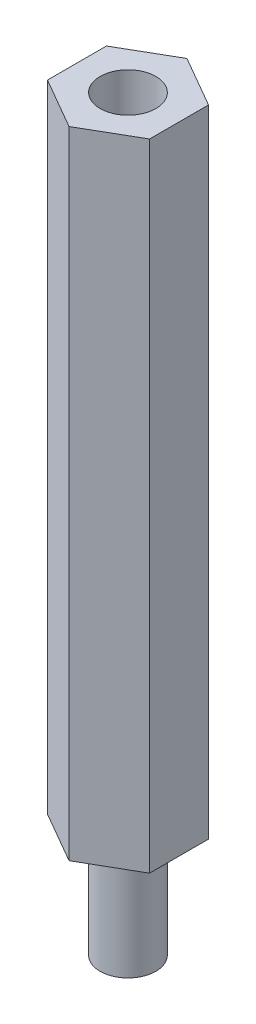
ISO-10303-21;
HEADER;
FILE_DESCRIPTION(('STEP AP214'),'2;1');
FILE_NAME('part.step','',(''),(''),'','','');
FILE_SCHEMA(('AUTOMOTIVE_DESIGN { 1 0 10303 214 1 1 1 1 }'));
ENDSEC;
DATA;
#1=APPLICATION_CONTEXT('core data for automotive mechanical design processes');
#2=APPLICATION_PROTOCOL_DEFINITION('international standard','automotive_design',2000,#1);
#3=PRODUCT_CONTEXT('',#1,'mechanical');
#4=PRODUCT('Part','Part','',(#3));
#5=PRODUCT_RELATED_PRODUCT_CATEGORY('part','',(#4));
#6=PRODUCT_DEFINITION_FORMATION('','',#4);
#7=PRODUCT_DEFINITION_CONTEXT('part definition',#1,'design');
#8=PRODUCT_DEFINITION('design','',#6,#7);
#9=PRODUCT_DEFINITION_SHAPE('','',#8);
#10=(LENGTH_UNIT() NAMED_UNIT(*) SI_UNIT(.MILLI.,.METRE.));
#11=(NAMED_UNIT(*) PLANE_ANGLE_UNIT() SI_UNIT($,.RADIAN.));
#12=(NAMED_UNIT(*) SI_UNIT($,.STERADIAN.) SOLID_ANGLE_UNIT());
#13=UNCERTAINTY_MEASURE_WITH_UNIT(LENGTH_MEASURE(1.E-05),#10,'distance_accuracy_value','');
#14=(GEOMETRIC_REPRESENTATION_CONTEXT(3) GLOBAL_UNCERTAINTY_ASSIGNED_CONTEXT((#13)) GLOBAL_UNIT_ASSIGNED_CONTEXT((#10,
#11,#12)) REPRESENTATION_CONTEXT('',''));
#15=CARTESIAN_POINT('',(0.,0.,0.));
#16=DIRECTION('',(0.,0.,1.));
#17=DIRECTION('',(1.,0.,0.));
#18=AXIS2_PLACEMENT_3D('',#15,#16,#17);
#19=CARTESIAN_POINT('',(-1.397,34.798,2.41967497817372));
#20=DIRECTION('',(0.5,0.,-0.866025403784438));
#21=DIRECTION('',(-0.866025403784438,0.,-0.5));
#22=AXIS2_PLACEMENT_3D('',#19,#20,#21);
#23=PLANE('',#22);
#24=DIRECTION('',(0.866025403784438,0.,0.5));
#25=VECTOR('',#24,1.);
#26=CARTESIAN_POINT('',(-1.397,0.,2.41967497817372));
#27=LINE('',#26,#25);
#28=CARTESIAN_POINT('',(-2.794,0.,1.61311665211581));
#29=VERTEX_POINT('',#28);
#30=CARTESIAN_POINT('',(0.,0.,3.22623330423163));
#31=VERTEX_POINT('',#30);
#32=EDGE_CURVE('E118',#29,#31,#27,.T.);
#33=ORIENTED_EDGE('',*,*,#32,.T.);
#34=DIRECTION('',(0.,-1.,0.));
#35=VECTOR('',#34,1.);
#36=CARTESIAN_POINT('',(0.,34.798,3.22623330423163));
#37=LINE('',#36,#35);
#38=CARTESIAN_POINT('',(0.,34.798,3.22623330423163));
#39=VERTEX_POINT('',#38);
#40=EDGE_CURVE('E11',#39,#31,#37,.T.);
#41=ORIENTED_EDGE('',*,*,#40,.F.);
#42=DIRECTION('',(0.866025403784438,0.,0.5));
#43=VECTOR('',#42,1.);
#44=CARTESIAN_POINT('',(-1.397,34.798,2.41967497817372));
#45=LINE('',#44,#43);
#46=CARTESIAN_POINT('',(-2.794,34.798,1.61311665211581));
#47=VERTEX_POINT('',#46);
#48=EDGE_CURVE('E129',#47,#39,#45,.T.);
#49=ORIENTED_EDGE('',*,*,#48,.F.);
#50=DIRECTION('',(0.,-1.,0.));
#51=VECTOR('',#50,1.);
#52=CARTESIAN_POINT('',(-2.794,34.798,1.61311665211581));
#53=LINE('',#52,#51);
#54=EDGE_CURVE('E114',#47,#29,#53,.T.);
#55=ORIENTED_EDGE('',*,*,#54,.T.);
#56=EDGE_LOOP('',(#33,#41,#49,#55));
#57=FACE_BOUND('',#56,.T.);
#58=ADVANCED_FACE('F34',(#57),#23,.F.);
#59=CARTESIAN_POINT('',(1.397,34.798,2.41967497817372));
#60=DIRECTION('',(-0.5,0.,-0.866025403784439));
#61=DIRECTION('',(-0.866025403784439,0.,0.5));
#62=AXIS2_PLACEMENT_3D('',#59,#60,#61);
#63=PLANE('',#62);
#64=DIRECTION('',(0.866025403784439,0.,-0.5));
#65=VECTOR('',#64,1.);
#66=CARTESIAN_POINT('',(1.397,0.,2.41967497817372));
#67=LINE('',#66,#65);
#68=CARTESIAN_POINT('',(2.794,0.,1.61311665211582));
#69=VERTEX_POINT('',#68);
#70=EDGE_CURVE('E121',#31,#69,#67,.T.);
#71=ORIENTED_EDGE('',*,*,#70,.T.);
#72=DIRECTION('',(0.,-1.,0.));
#73=VECTOR('',#72,1.);
#74=CARTESIAN_POINT('',(2.794,34.798,1.61311665211582));
#75=LINE('',#74,#73);
#76=CARTESIAN_POINT('',(2.794,34.798,1.61311665211582));
#77=VERTEX_POINT('',#76);
#78=EDGE_CURVE('E42',#77,#69,#75,.T.);
#79=ORIENTED_EDGE('',*,*,#78,.F.);
#80=DIRECTION('',(0.866025403784439,0.,-0.5));
#81=VECTOR('',#80,1.);
#82=CARTESIAN_POINT('',(1.397,34.798,2.41967497817372));
#83=LINE('',#82,#81);
#84=EDGE_CURVE('E87',#39,#77,#83,.T.);
#85=ORIENTED_EDGE('',*,*,#84,.F.);
#86=ORIENTED_EDGE('',*,*,#40,.T.);
#87=EDGE_LOOP('',(#71,#79,#85,#86));
#88=FACE_BOUND('',#87,.T.);
#89=ADVANCED_FACE('F154',(#88),#63,.F.);
#90=CARTESIAN_POINT('',(2.794,34.798,0.));
#91=DIRECTION('',(-1.,0.,0.));
#92=DIRECTION('',(0.,0.,1.));
#93=AXIS2_PLACEMENT_3D('',#90,#91,#92);
#94=PLANE('',#93);
#95=DIRECTION('',(0.,0.,-1.));
#96=VECTOR('',#95,1.);
#97=CARTESIAN_POINT('',(2.794,0.,0.));
#98=LINE('',#97,#96);
#99=CARTESIAN_POINT('',(2.794,0.,-1.61311665211581));
#100=VERTEX_POINT('',#99);
#101=EDGE_CURVE('E124',#69,#100,#98,.T.);
#102=ORIENTED_EDGE('',*,*,#101,.T.);
#103=DIRECTION('',(0.,-1.,0.));
#104=VECTOR('',#103,1.);
#105=CARTESIAN_POINT('',(2.794,34.798,-1.61311665211581));
#106=LINE('',#105,#104);
#107=CARTESIAN_POINT('',(2.794,34.798,-1.61311665211581));
#108=VERTEX_POINT('',#107);
#109=EDGE_CURVE('E109',#108,#100,#106,.T.);
#110=ORIENTED_EDGE('',*,*,#109,.F.);
#111=DIRECTION('',(0.,0.,-1.));
#112=VECTOR('',#111,1.);
#113=CARTESIAN_POINT('',(2.794,34.798,0.));
#114=LINE('',#113,#112);
#115=EDGE_CURVE('E100',#77,#108,#114,.T.);
#116=ORIENTED_EDGE('',*,*,#115,.F.);
#117=ORIENTED_EDGE('',*,*,#78,.T.);
#118=EDGE_LOOP('',(#102,#110,#116,#117));
#119=FACE_BOUND('',#118,.T.);
#120=ADVANCED_FACE('F135',(#119),#94,.F.);
#121=CARTESIAN_POINT('',(1.397,34.798,-2.41967497817372));
#122=DIRECTION('',(-0.5,0.,0.866025403784438));
#123=DIRECTION('',(0.866025403784439,0.,0.5));
#124=AXIS2_PLACEMENT_3D('',#121,#122,#123);
#125=PLANE('',#124);
#126=DIRECTION('',(-0.866025403784439,0.,-0.5));
#127=VECTOR('',#126,1.);
#128=CARTESIAN_POINT('',(1.397,0.,-2.41967497817372));
#129=LINE('',#128,#127);
#130=CARTESIAN_POINT('',(0.,0.,-3.22623330423163));
#131=VERTEX_POINT('',#130);
#132=EDGE_CURVE('E108',#100,#131,#129,.T.);
#133=ORIENTED_EDGE('',*,*,#132,.T.);
#134=DIRECTION('',(0.,-1.,0.));
#135=VECTOR('',#134,1.);
#136=CARTESIAN_POINT('',(0.,34.798,-3.22623330423163));
#137=LINE('',#136,#135);
#138=CARTESIAN_POINT('',(0.,34.798,-3.22623330423163));
#139=VERTEX_POINT('',#138);
#140=EDGE_CURVE('E105',#139,#131,#137,.T.);
#141=ORIENTED_EDGE('',*,*,#140,.F.);
#142=DIRECTION('',(-0.866025403784439,0.,-0.5));
#143=VECTOR('',#142,1.);
#144=CARTESIAN_POINT('',(1.397,34.798,-2.41967497817372));
#145=LINE('',#144,#143);
#146=EDGE_CURVE('E94',#108,#139,#145,.T.);
#147=ORIENTED_EDGE('',*,*,#146,.F.);
#148=ORIENTED_EDGE('',*,*,#109,.T.);
#149=EDGE_LOOP('',(#133,#141,#147,#148));
#150=FACE_BOUND('',#149,.T.);
#151=ADVANCED_FACE('F106',(#150),#125,.F.);
#152=CARTESIAN_POINT('',(-1.397,34.798,-2.41967497817372));
#153=DIRECTION('',(0.5,0.,0.866025403784439));
#154=DIRECTION('',(0.866025403784439,0.,-0.5));
#155=AXIS2_PLACEMENT_3D('',#152,#153,#154);
#156=PLANE('',#155);
#157=DIRECTION('',(-0.866025403784439,0.,0.5));
#158=VECTOR('',#157,1.);
#159=CARTESIAN_POINT('',(-1.397,0.,-2.41967497817372));
#160=LINE('',#159,#158);
#161=CARTESIAN_POINT('',(-2.794,0.,-1.61311665211582));
#162=VERTEX_POINT('',#161);
#163=EDGE_CURVE('E73',#131,#162,#160,.T.);
#164=ORIENTED_EDGE('',*,*,#163,.T.);
#165=DIRECTION('',(0.,-1.,0.));
#166=VECTOR('',#165,1.);
#167=CARTESIAN_POINT('',(-2.794,34.798,-1.61311665211582));
#168=LINE('',#167,#166);
#169=CARTESIAN_POINT('',(-2.794,34.798,-1.61311665211582));
#170=VERTEX_POINT('',#169);
#171=EDGE_CURVE('E110',#170,#162,#168,.T.);
#172=ORIENTED_EDGE('',*,*,#171,.F.);
#173=DIRECTION('',(-0.866025403784439,0.,0.5));
#174=VECTOR('',#173,1.);
#175=CARTESIAN_POINT('',(-1.397,34.798,-2.41967497817372));
#176=LINE('',#175,#174);
#177=EDGE_CURVE('E98',#139,#170,#176,.T.);
#178=ORIENTED_EDGE('',*,*,#177,.F.);
#179=ORIENTED_EDGE('',*,*,#140,.T.);
#180=EDGE_LOOP('',(#164,#172,#178,#179));
#181=FACE_BOUND('',#180,.T.);
#182=ADVANCED_FACE('F112',(#181),#156,.F.);
#183=CARTESIAN_POINT('',(-2.794,34.798,0.));
#184=DIRECTION('',(1.,0.,0.));
#185=DIRECTION('',(0.,0.,-1.));
#186=AXIS2_PLACEMENT_3D('',#183,#184,#185);
#187=PLANE('',#186);
#188=DIRECTION('',(0.,0.,1.));
#189=VECTOR('',#188,1.);
#190=CARTESIAN_POINT('',(-2.794,0.,0.));
#191=LINE('',#190,#189);
#192=EDGE_CURVE('E79',#162,#29,#191,.T.);
#193=ORIENTED_EDGE('',*,*,#192,.T.);
#194=ORIENTED_EDGE('',*,*,#54,.F.);
#195=DIRECTION('',(0.,0.,1.));
#196=VECTOR('',#195,1.);
#197=CARTESIAN_POINT('',(-2.794,34.798,0.));
#198=LINE('',#197,#196);
#199=EDGE_CURVE('E50',#170,#47,#198,.T.);
#200=ORIENTED_EDGE('',*,*,#199,.F.);
#201=ORIENTED_EDGE('',*,*,#171,.T.);
#202=EDGE_LOOP('',(#193,#194,#200,#201));
#203=FACE_BOUND('',#202,.T.);
#204=ADVANCED_FACE('F142',(#203),#187,.F.);
#205=CARTESIAN_POINT('',(0.,34.798,0.));
#206=DIRECTION('',(0.,1.,0.));
#207=DIRECTION('',(0.,0.,1.));
#208=AXIS2_PLACEMENT_3D('',#205,#206,#207);
#209=PLANE('',#208);
#210=CARTESIAN_POINT('',(0.,34.798,0.));
#211=DIRECTION('',(0.,1.,0.));
#212=DIRECTION('',(0.,0.,1.));
#213=AXIS2_PLACEMENT_3D('',#210,#211,#212);
#214=CIRCLE('',#213,1.524);
#215=CARTESIAN_POINT('',(0.,34.798,1.524));
#216=VERTEX_POINT('',#215);
#217=EDGE_CURVE('E238',#216,#216,#214,.T.);
#218=ORIENTED_EDGE('',*,*,#217,.F.);
#219=EDGE_LOOP('',(#218));
#220=FACE_BOUND('',#219,.T.);
#221=ORIENTED_EDGE('',*,*,#48,.T.);
#222=ORIENTED_EDGE('',*,*,#84,.T.);
#223=ORIENTED_EDGE('',*,*,#115,.T.);
#224=ORIENTED_EDGE('',*,*,#146,.T.);
#225=ORIENTED_EDGE('',*,*,#177,.T.);
#226=ORIENTED_EDGE('',*,*,#199,.T.);
#227=EDGE_LOOP('',(#221,#222,#223,#224,#225,#226));
#228=FACE_BOUND('',#227,.T.);
#229=ADVANCED_FACE('F96',(#220,#228),#209,.T.);
#230=CARTESIAN_POINT('',(0.,0.,0.));
#231=DIRECTION('',(0.,1.,0.));
#232=DIRECTION('',(0.,0.,1.));
#233=AXIS2_PLACEMENT_3D('',#230,#231,#232);
#234=PLANE('',#233);
#235=CARTESIAN_POINT('',(0.,0.,0.));
#236=DIRECTION('',(0.,1.,0.));
#237=DIRECTION('',(0.,0.,1.));
#238=AXIS2_PLACEMENT_3D('',#235,#236,#237);
#239=CIRCLE('',#238,1.524);
#240=CARTESIAN_POINT('',(0.,0.,1.524));
#241=VERTEX_POINT('',#240);
#242=EDGE_CURVE('E237',#241,#241,#239,.T.);
#243=ORIENTED_EDGE('',*,*,#242,.T.);
#244=EDGE_LOOP('',(#243));
#245=FACE_BOUND('',#244,.T.);
#246=ORIENTED_EDGE('',*,*,#32,.F.);
#247=ORIENTED_EDGE('',*,*,#192,.F.);
#248=ORIENTED_EDGE('',*,*,#163,.F.);
#249=ORIENTED_EDGE('',*,*,#132,.F.);
#250=ORIENTED_EDGE('',*,*,#101,.F.);
#251=ORIENTED_EDGE('',*,*,#70,.F.);
#252=EDGE_LOOP('',(#246,#247,#248,#249,#250,#251));
#253=FACE_BOUND('',#252,.T.);
#254=ADVANCED_FACE('F138',(#245,#253),#234,.F.);
#255=CARTESIAN_POINT('',(0.,-6.096,0.));
#256=DIRECTION('',(0.,1.,0.));
#257=DIRECTION('',(0.,0.,1.));
#258=AXIS2_PLACEMENT_3D('',#255,#256,#257);
#259=CYLINDRICAL_SURFACE('',#258,1.524);
#260=CARTESIAN_POINT('',(0.,-6.096,0.));
#261=DIRECTION('',(0.,1.,0.));
#262=DIRECTION('',(0.,0.,1.));
#263=AXIS2_PLACEMENT_3D('',#260,#261,#262);
#264=CIRCLE('',#263,1.524);
#265=CARTESIAN_POINT('',(0.,-6.096,1.524));
#266=VERTEX_POINT('',#265);
#267=EDGE_CURVE('E122',#266,#266,#264,.T.);
#268=CARTESIAN_POINT('',(0.,-6.096,1.524));
#269=CARTESIAN_POINT('',(0.,-6.0325,1.524));
#270=CARTESIAN_POINT('',(0.,-5.969,1.524));
#271=CARTESIAN_POINT('',(0.,-5.842,1.524));
#272=CARTESIAN_POINT('',(0.,-5.7785,1.524));
#273=CARTESIAN_POINT('',(0.,-5.6515,1.524));
#274=CARTESIAN_POINT('',(0.,-5.588,1.524));
#275=CARTESIAN_POINT('',(0.,-5.461,1.524));
#276=CARTESIAN_POINT('',(0.,-5.3975,1.524));
#277=CARTESIAN_POINT('',(0.,-5.2705,1.524));
#278=CARTESIAN_POINT('',(0.,-5.207,1.524));
#279=CARTESIAN_POINT('',(0.,-5.08,1.524));
#280=CARTESIAN_POINT('',(0.,-5.0165,1.524));
#281=CARTESIAN_POINT('',(0.,-4.8895,1.524));
#282=CARTESIAN_POINT('',(0.,-4.826,1.524));
#283=CARTESIAN_POINT('',(0.,-4.699,1.524));
#284=CARTESIAN_POINT('',(0.,-4.6355,1.524));
#285=CARTESIAN_POINT('',(0.,-4.5085,1.524));
#286=CARTESIAN_POINT('',(0.,-4.445,1.524));
#287=CARTESIAN_POINT('',(0.,-4.318,1.524));
#288=CARTESIAN_POINT('',(0.,-4.2545,1.524));
#289=CARTESIAN_POINT('',(0.,-4.1275,1.524));
#290=CARTESIAN_POINT('',(0.,-4.064,1.524));
#291=CARTESIAN_POINT('',(0.,-3.937,1.524));
#292=CARTESIAN_POINT('',(0.,-3.8735,1.524));
#293=CARTESIAN_POINT('',(0.,-3.7465,1.524));
#294=CARTESIAN_POINT('',(0.,-3.683,1.524));
#295=CARTESIAN_POINT('',(0.,-3.556,1.524));
#296=CARTESIAN_POINT('',(0.,-3.4925,1.524));
#297=CARTESIAN_POINT('',(0.,-3.3655,1.524));
#298=CARTESIAN_POINT('',(0.,-3.302,1.524));
#299=CARTESIAN_POINT('',(0.,-3.175,1.524));
#300=CARTESIAN_POINT('',(0.,-3.1115,1.524));
#301=CARTESIAN_POINT('',(0.,-2.9845,1.524));
#302=CARTESIAN_POINT('',(0.,-2.921,1.524));
#303=CARTESIAN_POINT('',(0.,-2.794,1.524));
#304=CARTESIAN_POINT('',(0.,-2.7305,1.524));
#305=CARTESIAN_POINT('',(0.,-2.6035,1.524));
#306=CARTESIAN_POINT('',(0.,-2.54,1.524));
#307=CARTESIAN_POINT('',(0.,-2.413,1.524));
#308=CARTESIAN_POINT('',(0.,-2.3495,1.524));
#309=CARTESIAN_POINT('',(0.,-2.2225,1.524));
#310=CARTESIAN_POINT('',(0.,-2.159,1.524));
#311=CARTESIAN_POINT('',(0.,-2.032,1.524));
#312=CARTESIAN_POINT('',(0.,-1.9685,1.524));
#313=CARTESIAN_POINT('',(0.,-1.8415,1.524));
#314=CARTESIAN_POINT('',(0.,-1.778,1.524));
#315=CARTESIAN_POINT('',(0.,-1.651,1.524));
#316=CARTESIAN_POINT('',(0.,-1.5875,1.524));
#317=CARTESIAN_POINT('',(0.,-1.4605,1.524));
#318=CARTESIAN_POINT('',(0.,-1.397,1.524));
#319=CARTESIAN_POINT('',(0.,-1.27,1.524));
#320=CARTESIAN_POINT('',(0.,-1.2065,1.524));
#321=CARTESIAN_POINT('',(0.,-1.0795,1.524));
#322=CARTESIAN_POINT('',(0.,-1.016,1.524));
#323=CARTESIAN_POINT('',(0.,-0.889,1.524));
#324=CARTESIAN_POINT('',(0.,-0.8255,1.524));
#325=CARTESIAN_POINT('',(0.,-0.6985,1.524));
#326=CARTESIAN_POINT('',(0.,-0.635,1.524));
#327=CARTESIAN_POINT('',(0.,-0.508,1.524));
#328=CARTESIAN_POINT('',(0.,-0.4445,1.524));
#329=CARTESIAN_POINT('',(0.,-0.3175,1.524));
#330=CARTESIAN_POINT('',(0.,-0.254,1.524));
#331=CARTESIAN_POINT('',(0.,-0.127,1.524));
#332=CARTESIAN_POINT('',(0.,-0.0634999999999999,1.524));
#333=CARTESIAN_POINT('',(0.,0.,1.524));
#334=B_SPLINE_CURVE_WITH_KNOTS('',3,(#268,#269,#270,#271,#272,#273,#274,#275,#276,#277,#278,
#279,#280,#281,#282,#283,#284,#285,#286,#287,#288,#289,#290,#291,#292,#293,#294,#295,#296,#297,
#298,#299,#300,#301,#302,#303,#304,#305,#306,#307,#308,#309,#310,#311,#312,#313,#314,#315,#316,
#317,#318,#319,#320,#321,#322,#323,#324,#325,#326,#327,#328,#329,#330,#331,#332,#333),
.UNSPECIFIED.,.F.,.F.,(4,2,2,2,2,2,2,2,2,2,2,2,2,2,2,2,2,2,2,2,2,2,2,2,2,2,2,2,2,2,2,2,4),(0.,
0.1905,0.380999999999999,0.5715,0.762,0.952499999999999,1.143,1.3335,1.524,1.7145,1.905,2.0955,
2.286,2.4765,2.667,2.8575,3.048,3.2385,3.429,3.6195,3.81,4.0005,4.191,4.3815,4.572,4.7625,4.953,
5.1435,5.334,5.5245,5.715,5.9055,6.096),.UNSPECIFIED.);
#335=EDGE_CURVE('BSEAM186',#266,#241,#334,.T.);
#336=ORIENTED_EDGE('',*,*,#267,.T.);
#337=ORIENTED_EDGE('',*,*,#242,.F.);
#338=ORIENTED_EDGE('',*,*,#335,.T.);
#339=ORIENTED_EDGE('',*,*,#335,.F.);
#340=EDGE_LOOP('',(#336,#338,#337,#339));
#341=FACE_BOUND('',#340,.T.);
#342=ADVANCED_FACE('F186',(#341),#259,.T.);
#343=CARTESIAN_POINT('',(0.,-6.096,0.));
#344=DIRECTION('',(0.,1.,0.));
#345=DIRECTION('',(0.,0.,1.));
#346=AXIS2_PLACEMENT_3D('',#343,#344,#345);
#347=PLANE('',#346);
#348=ORIENTED_EDGE('',*,*,#267,.F.);
#349=EDGE_LOOP('',(#348));
#350=FACE_BOUND('',#349,.T.);
#351=ADVANCED_FACE('F195',(#350),#347,.F.);
#352=CARTESIAN_POINT('',(0.,28.702,0.));
#353=DIRECTION('',(0.,1.,0.));
#354=DIRECTION('',(0.,0.,1.));
#355=AXIS2_PLACEMENT_3D('',#352,#353,#354);
#356=CYLINDRICAL_SURFACE('',#355,1.524);
#357=CARTESIAN_POINT('',(0.,28.702,0.));
#358=DIRECTION('',(0.,1.,0.));
#359=DIRECTION('',(0.,0.,1.));
#360=AXIS2_PLACEMENT_3D('',#357,#358,#359);
#361=CIRCLE('',#360,1.524);
#362=CARTESIAN_POINT('',(0.,28.702,1.524));
#363=VERTEX_POINT('',#362);
#364=EDGE_CURVE('E236',#363,#363,#361,.T.);
#365=CARTESIAN_POINT('',(0.,28.702,1.524));
#366=CARTESIAN_POINT('',(0.,28.7655,1.524));
#367=CARTESIAN_POINT('',(0.,28.829,1.524));
#368=CARTESIAN_POINT('',(0.,28.956,1.524));
#369=CARTESIAN_POINT('',(0.,29.0195,1.524));
#370=CARTESIAN_POINT('',(0.,29.1465,1.524));
#371=CARTESIAN_POINT('',(0.,29.21,1.524));
#372=CARTESIAN_POINT('',(0.,29.337,1.524));
#373=CARTESIAN_POINT('',(0.,29.4005,1.524));
#374=CARTESIAN_POINT('',(0.,29.5275,1.524));
#375=CARTESIAN_POINT('',(0.,29.591,1.524));
#376=CARTESIAN_POINT('',(0.,29.718,1.524));
#377=CARTESIAN_POINT('',(0.,29.7815,1.524));
#378=CARTESIAN_POINT('',(0.,29.9085,1.524));
#379=CARTESIAN_POINT('',(0.,29.972,1.524));
#380=CARTESIAN_POINT('',(0.,30.099,1.524));
#381=CARTESIAN_POINT('',(0.,30.1625,1.524));
#382=CARTESIAN_POINT('',(0.,30.2895,1.524));
#383=CARTESIAN_POINT('',(0.,30.353,1.524));
#384=CARTESIAN_POINT('',(0.,30.48,1.524));
#385=CARTESIAN_POINT('',(0.,30.5435,1.524));
#386=CARTESIAN_POINT('',(0.,30.6705,1.524));
#387=CARTESIAN_POINT('',(0.,30.734,1.524));
#388=CARTESIAN_POINT('',(0.,30.861,1.524));
#389=CARTESIAN_POINT('',(0.,30.9245,1.524));
#390=CARTESIAN_POINT('',(0.,31.0515,1.524));
#391=CARTESIAN_POINT('',(0.,31.115,1.524));
#392=CARTESIAN_POINT('',(0.,31.242,1.524));
#393=CARTESIAN_POINT('',(0.,31.3055,1.524));
#394=CARTESIAN_POINT('',(0.,31.4325,1.524));
#395=CARTESIAN_POINT('',(0.,31.496,1.524));
#396=CARTESIAN_POINT('',(0.,31.623,1.524));
#397=CARTESIAN_POINT('',(0.,31.6865,1.524));
#398=CARTESIAN_POINT('',(0.,31.8135,1.524));
#399=CARTESIAN_POINT('',(0.,31.877,1.524));
#400=CARTESIAN_POINT('',(0.,32.004,1.524));
#401=CARTESIAN_POINT('',(0.,32.0675,1.524));
#402=CARTESIAN_POINT('',(0.,32.1945,1.524));
#403=CARTESIAN_POINT('',(0.,32.258,1.524));
#404=CARTESIAN_POINT('',(0.,32.385,1.524));
#405=CARTESIAN_POINT('',(0.,32.4485,1.524));
#406=CARTESIAN_POINT('',(0.,32.5755,1.524));
#407=CARTESIAN_POINT('',(0.,32.639,1.524));
#408=CARTESIAN_POINT('',(0.,32.766,1.524));
#409=CARTESIAN_POINT('',(0.,32.8295,1.524));
#410=CARTESIAN_POINT('',(0.,32.9565,1.524));
#411=CARTESIAN_POINT('',(0.,33.02,1.524));
#412=CARTESIAN_POINT('',(0.,33.147,1.524));
#413=CARTESIAN_POINT('',(0.,33.2105,1.524));
#414=CARTESIAN_POINT('',(0.,33.3375,1.524));
#415=CARTESIAN_POINT('',(0.,33.401,1.524));
#416=CARTESIAN_POINT('',(0.,33.528,1.524));
#417=CARTESIAN_POINT('',(0.,33.5915,1.524));
#418=CARTESIAN_POINT('',(0.,33.7185,1.524));
#419=CARTESIAN_POINT('',(0.,33.782,1.524));
#420=CARTESIAN_POINT('',(0.,33.909,1.524));
#421=CARTESIAN_POINT('',(0.,33.9725,1.524));
#422=CARTESIAN_POINT('',(0.,34.0995,1.524));
#423=CARTESIAN_POINT('',(0.,34.163,1.524));
#424=CARTESIAN_POINT('',(0.,34.29,1.524));
#425=CARTESIAN_POINT('',(0.,34.3535,1.524));
#426=CARTESIAN_POINT('',(0.,34.4805,1.524));
#427=CARTESIAN_POINT('',(0.,34.544,1.524));
#428=CARTESIAN_POINT('',(0.,34.671,1.524));
#429=CARTESIAN_POINT('',(0.,34.7345,1.524));
#430=CARTESIAN_POINT('',(0.,34.798,1.524));
#431=B_SPLINE_CURVE_WITH_KNOTS('',3,(#365,#366,#367,#368,#369,#370,#371,#372,#373,#374,#375,
#376,#377,#378,#379,#380,#381,#382,#383,#384,#385,#386,#387,#388,#389,#390,#391,#392,#393,#394,
#395,#396,#397,#398,#399,#400,#401,#402,#403,#404,#405,#406,#407,#408,#409,#410,#411,#412,#413,
#414,#415,#416,#417,#418,#419,#420,#421,#422,#423,#424,#425,#426,#427,#428,#429,#430),
.UNSPECIFIED.,.F.,.F.,(4,2,2,2,2,2,2,2,2,2,2,2,2,2,2,2,2,2,2,2,2,2,2,2,2,2,2,2,2,2,2,2,4),(0.,
0.1905,0.380999999999999,0.571499999999999,0.761999999999999,0.952499999999998,1.143,1.3335,
1.524,1.7145,1.905,2.0955,2.286,2.4765,2.667,2.8575,3.048,3.23849999999999,3.429,3.6195,3.81,
4.0005,4.191,4.3815,4.572,4.7625,4.953,5.1435,5.334,5.5245,5.715,5.9055,6.096),.UNSPECIFIED.);
#432=EDGE_CURVE('BSEAM205',#363,#216,#431,.T.);
#433=ORIENTED_EDGE('',*,*,#364,.F.);
#434=ORIENTED_EDGE('',*,*,#217,.T.);
#435=ORIENTED_EDGE('',*,*,#432,.T.);
#436=ORIENTED_EDGE('',*,*,#432,.F.);
#437=EDGE_LOOP('',(#433,#435,#434,#436));
#438=FACE_BOUND('',#437,.T.);
#439=ADVANCED_FACE('F205',(#438),#356,.F.);
#440=CARTESIAN_POINT('',(0.,28.702,0.));
#441=DIRECTION('',(0.,1.,0.));
#442=DIRECTION('',(0.,0.,1.));
#443=AXIS2_PLACEMENT_3D('',#440,#441,#442);
#444=PLANE('',#443);
#445=ORIENTED_EDGE('',*,*,#364,.T.);
#446=EDGE_LOOP('',(#445));
#447=FACE_BOUND('',#446,.T.);
#448=ADVANCED_FACE('F220',(#447),#444,.T.);
#449=CLOSED_SHELL('',(#58,#89,#120,#151,#182,#204,#229,#254,#342,#351,#439,#448));
#450=MANIFOLD_SOLID_BREP('B2',#449);
#451=ADVANCED_BREP_SHAPE_REPRESENTATION('',(#18,#450),#14);
#452=SHAPE_DEFINITION_REPRESENTATION(#9,#451);
ENDSEC;
END-ISO-10303-21;
